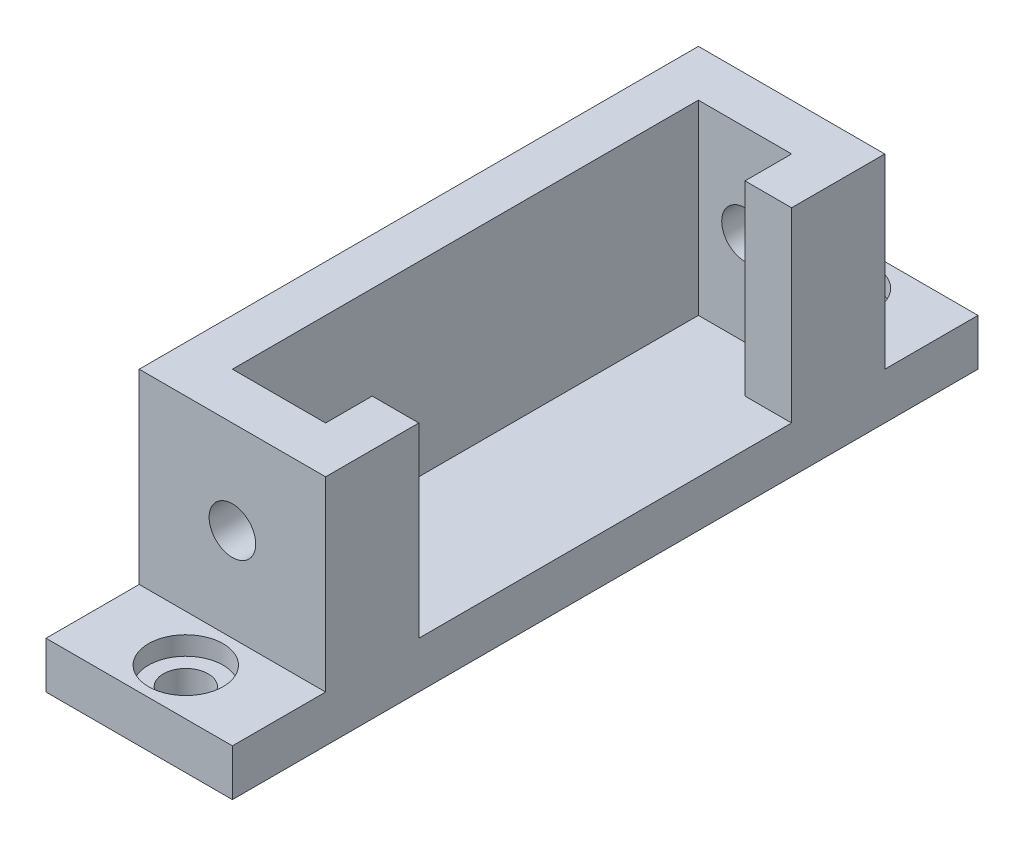
ISO-10303-21;
HEADER;
FILE_DESCRIPTION(('STEP AP214'),'2;1');
FILE_NAME('part.step','',(''),(''),'','','');
FILE_SCHEMA(('AUTOMOTIVE_DESIGN { 1 0 10303 214 1 1 1 1 }'));
ENDSEC;
DATA;
#1=APPLICATION_CONTEXT('core data for automotive mechanical design processes');
#2=APPLICATION_PROTOCOL_DEFINITION('international standard','automotive_design',2000,#1);
#3=PRODUCT_CONTEXT('',#1,'mechanical');
#4=PRODUCT('Part','Part','',(#3));
#5=PRODUCT_RELATED_PRODUCT_CATEGORY('part','',(#4));
#6=PRODUCT_DEFINITION_FORMATION('','',#4);
#7=PRODUCT_DEFINITION_CONTEXT('part definition',#1,'design');
#8=PRODUCT_DEFINITION('design','',#6,#7);
#9=PRODUCT_DEFINITION_SHAPE('','',#8);
#10=(LENGTH_UNIT() NAMED_UNIT(*) SI_UNIT(.MILLI.,.METRE.));
#11=(NAMED_UNIT(*) PLANE_ANGLE_UNIT() SI_UNIT($,.RADIAN.));
#12=(NAMED_UNIT(*) SI_UNIT($,.STERADIAN.) SOLID_ANGLE_UNIT());
#13=UNCERTAINTY_MEASURE_WITH_UNIT(LENGTH_MEASURE(1.E-05),#10,'distance_accuracy_value','');
#14=(GEOMETRIC_REPRESENTATION_CONTEXT(3) GLOBAL_UNCERTAINTY_ASSIGNED_CONTEXT((#13)) GLOBAL_UNIT_ASSIGNED_CONTEXT((#10,
#11,#12)) REPRESENTATION_CONTEXT('',''));
#15=CARTESIAN_POINT('',(0.,0.,0.));
#16=DIRECTION('',(0.,0.,1.));
#17=DIRECTION('',(1.,0.,0.));
#18=AXIS2_PLACEMENT_3D('',#15,#16,#17);
#19=CARTESIAN_POINT('',(0.,0.,0.));
#20=DIRECTION('',(0.,0.,1.));
#21=DIRECTION('',(1.,0.,0.));
#22=AXIS2_PLACEMENT_3D('',#19,#20,#21);
#23=PLANE('',#22);
#24=CARTESIAN_POINT('',(-9.94266872152012,25.,0.));
#25=DIRECTION('',(0.,0.,1.));
#26=DIRECTION('',(1.,0.,0.));
#27=AXIS2_PLACEMENT_3D('',#24,#25,#26);
#28=CIRCLE('',#27,2.5);
#29=CARTESIAN_POINT('',(-7.44266872152012,25.,0.));
#30=VERTEX_POINT('',#29);
#31=EDGE_CURVE('E237',#30,#30,#28,.T.);
#32=ORIENTED_EDGE('',*,*,#31,.T.);
#33=EDGE_LOOP('',(#32));
#34=FACE_BOUND('',#33,.T.);
#35=DIRECTION('',(1.,0.,0.));
#36=VECTOR('',#35,1.);
#37=CARTESIAN_POINT('',(0.,15.,0.));
#38=LINE('',#37,#36);
#39=CARTESIAN_POINT('',(-19.9426687215201,15.,0.));
#40=VERTEX_POINT('',#39);
#41=CARTESIAN_POINT('',(0.0573312784798757,15.,0.));
#42=VERTEX_POINT('',#41);
#43=EDGE_CURVE('E191',#40,#42,#38,.T.);
#44=ORIENTED_EDGE('',*,*,#43,.F.);
#45=DIRECTION('',(0.,1.,0.));
#46=VECTOR('',#45,1.);
#47=CARTESIAN_POINT('',(-19.9426687215201,0.,0.));
#48=LINE('',#47,#46);
#49=CARTESIAN_POINT('',(-19.9426687215201,35.,0.));
#50=VERTEX_POINT('',#49);
#51=EDGE_CURVE('E309',#40,#50,#48,.T.);
#52=ORIENTED_EDGE('',*,*,#51,.T.);
#53=DIRECTION('',(-1.,0.,0.));
#54=VECTOR('',#53,1.);
#55=CARTESIAN_POINT('',(0.,35.,0.));
#56=LINE('',#55,#54);
#57=CARTESIAN_POINT('',(0.0573312784798771,35.,0.));
#58=VERTEX_POINT('',#57);
#59=EDGE_CURVE('E328',#58,#50,#56,.T.);
#60=ORIENTED_EDGE('',*,*,#59,.F.);
#61=DIRECTION('',(0.,1.,0.));
#62=VECTOR('',#61,1.);
#63=CARTESIAN_POINT('',(0.0573312784798746,0.,0.));
#64=LINE('',#63,#62);
#65=EDGE_CURVE('E326',#42,#58,#64,.T.);
#66=ORIENTED_EDGE('',*,*,#65,.F.);
#67=EDGE_LOOP('',(#44,#52,#60,#66));
#68=FACE_BOUND('',#67,.T.);
#69=ADVANCED_FACE('F43',(#34,#68),#23,.F.);
#70=CARTESIAN_POINT('',(0.,0.,60.));
#71=DIRECTION('',(0.,0.,1.));
#72=DIRECTION('',(1.,0.,0.));
#73=AXIS2_PLACEMENT_3D('',#70,#71,#72);
#74=PLANE('',#73);
#75=CARTESIAN_POINT('',(-9.94266872152012,25.,60.));
#76=DIRECTION('',(0.,0.,1.));
#77=DIRECTION('',(1.,0.,0.));
#78=AXIS2_PLACEMENT_3D('',#75,#76,#77);
#79=CIRCLE('',#78,2.5);
#80=CARTESIAN_POINT('',(-7.44266872152012,25.,60.));
#81=VERTEX_POINT('',#80);
#82=EDGE_CURVE('E234',#81,#81,#79,.T.);
#83=ORIENTED_EDGE('',*,*,#82,.F.);
#84=EDGE_LOOP('',(#83));
#85=FACE_BOUND('',#84,.T.);
#86=DIRECTION('',(0.,1.,0.));
#87=VECTOR('',#86,1.);
#88=CARTESIAN_POINT('',(-19.9426687215201,0.,60.));
#89=LINE('',#88,#87);
#90=CARTESIAN_POINT('',(-19.9426687215201,15.,60.));
#91=VERTEX_POINT('',#90);
#92=CARTESIAN_POINT('',(-19.9426687215201,35.,60.));
#93=VERTEX_POINT('',#92);
#94=EDGE_CURVE('E60',#91,#93,#89,.T.);
#95=ORIENTED_EDGE('',*,*,#94,.F.);
#96=DIRECTION('',(1.,0.,0.));
#97=VECTOR('',#96,1.);
#98=CARTESIAN_POINT('',(0.,15.,60.));
#99=LINE('',#98,#97);
#100=CARTESIAN_POINT('',(0.0573312784798757,15.,60.));
#101=VERTEX_POINT('',#100);
#102=EDGE_CURVE('E65',#91,#101,#99,.T.);
#103=ORIENTED_EDGE('',*,*,#102,.T.);
#104=DIRECTION('',(0.,1.,0.));
#105=VECTOR('',#104,1.);
#106=CARTESIAN_POINT('',(0.0573312784798746,0.,60.));
#107=LINE('',#106,#105);
#108=CARTESIAN_POINT('',(0.0573312784798771,35.,60.));
#109=VERTEX_POINT('',#108);
#110=EDGE_CURVE('E313',#101,#109,#107,.T.);
#111=ORIENTED_EDGE('',*,*,#110,.T.);
#112=DIRECTION('',(-1.,0.,0.));
#113=VECTOR('',#112,1.);
#114=CARTESIAN_POINT('',(0.,35.,60.));
#115=LINE('',#114,#113);
#116=EDGE_CURVE('E315',#109,#93,#115,.T.);
#117=ORIENTED_EDGE('',*,*,#116,.T.);
#118=EDGE_LOOP('',(#95,#103,#111,#117));
#119=FACE_BOUND('',#118,.T.);
#120=ADVANCED_FACE('F393',(#85,#119),#74,.T.);
#121=CARTESIAN_POINT('',(0.0573312784798746,0.,60.));
#122=DIRECTION('',(-1.,0.,0.));
#123=DIRECTION('',(0.,-1.,0.));
#124=AXIS2_PLACEMENT_3D('',#121,#122,#123);
#125=PLANE('',#124);
#126=DIRECTION('',(0.,1.,0.));
#127=VECTOR('',#126,1.);
#128=CARTESIAN_POINT('',(0.0573312784798771,15.,10.));
#129=LINE('',#128,#127);
#130=CARTESIAN_POINT('',(0.0573312784798771,15.,10.));
#131=VERTEX_POINT('',#130);
#132=CARTESIAN_POINT('',(0.0573312784798771,35.,10.));
#133=VERTEX_POINT('',#132);
#134=EDGE_CURVE('E298',#131,#133,#129,.T.);
#135=ORIENTED_EDGE('',*,*,#134,.F.);
#136=DIRECTION('',(0.,0.,-1.));
#137=VECTOR('',#136,1.);
#138=CARTESIAN_POINT('',(0.0573312784798771,15.,0.));
#139=LINE('',#138,#137);
#140=CARTESIAN_POINT('',(0.0573312784798771,15.,50.));
#141=VERTEX_POINT('',#140);
#142=EDGE_CURVE('E252',#141,#131,#139,.T.);
#143=ORIENTED_EDGE('',*,*,#142,.F.);
#144=DIRECTION('',(0.,1.,0.));
#145=VECTOR('',#144,1.);
#146=CARTESIAN_POINT('',(0.0573312784798771,15.,50.));
#147=LINE('',#146,#145);
#148=CARTESIAN_POINT('',(0.0573312784798771,35.,50.));
#149=VERTEX_POINT('',#148);
#150=EDGE_CURVE('E300',#141,#149,#147,.T.);
#151=ORIENTED_EDGE('',*,*,#150,.T.);
#152=DIRECTION('',(0.,0.,-1.));
#153=VECTOR('',#152,1.);
#154=CARTESIAN_POINT('',(0.0573312784798771,35.,60.));
#155=LINE('',#154,#153);
#156=EDGE_CURVE('E340',#109,#149,#155,.T.);
#157=ORIENTED_EDGE('',*,*,#156,.F.);
#158=ORIENTED_EDGE('',*,*,#110,.F.);
#159=DIRECTION('',(0.,0.,-1.));
#160=VECTOR('',#159,1.);
#161=CARTESIAN_POINT('',(0.0573312784798757,15.,70.));
#162=LINE('',#161,#160);
#163=CARTESIAN_POINT('',(0.0573312784798757,15.,70.));
#164=VERTEX_POINT('',#163);
#165=EDGE_CURVE('E225',#164,#101,#162,.T.);
#166=ORIENTED_EDGE('',*,*,#165,.F.);
#167=DIRECTION('',(0.,1.,0.));
#168=VECTOR('',#167,1.);
#169=CARTESIAN_POINT('',(0.0573312784798746,0.,70.));
#170=LINE('',#169,#168);
#171=CARTESIAN_POINT('',(0.0573312784798753,9.99999999999998,70.));
#172=VERTEX_POINT('',#171);
#173=EDGE_CURVE('E223',#172,#164,#170,.T.);
#174=ORIENTED_EDGE('',*,*,#173,.F.);
#175=DIRECTION('',(0.,0.,-1.));
#176=VECTOR('',#175,1.);
#177=CARTESIAN_POINT('',(0.0573312784798753,9.99999999999998,60.));
#178=LINE('',#177,#176);
#179=CARTESIAN_POINT('',(0.0573312784798753,9.99999999999998,-10.));
#180=VERTEX_POINT('',#179);
#181=EDGE_CURVE('E204',#172,#180,#178,.T.);
#182=ORIENTED_EDGE('',*,*,#181,.T.);
#183=DIRECTION('',(0.,1.,0.));
#184=VECTOR('',#183,1.);
#185=CARTESIAN_POINT('',(0.0573312784798746,0.,-10.));
#186=LINE('',#185,#184);
#187=CARTESIAN_POINT('',(0.0573312784798757,15.,-10.));
#188=VERTEX_POINT('',#187);
#189=EDGE_CURVE('E186',#180,#188,#186,.T.);
#190=ORIENTED_EDGE('',*,*,#189,.T.);
#191=DIRECTION('',(0.,0.,1.));
#192=VECTOR('',#191,1.);
#193=CARTESIAN_POINT('',(0.0573312784798757,15.,-10.));
#194=LINE('',#193,#192);
#195=EDGE_CURVE('E194',#188,#42,#194,.T.);
#196=ORIENTED_EDGE('',*,*,#195,.T.);
#197=ORIENTED_EDGE('',*,*,#65,.T.);
#198=EDGE_CURVE('E339',#133,#58,#155,.T.);
#199=ORIENTED_EDGE('',*,*,#198,.F.);
#200=EDGE_LOOP('',(#135,#143,#151,#157,#158,#166,#174,#182,#190,#196,#197,#199));
#201=FACE_BOUND('',#200,.T.);
#202=ADVANCED_FACE('F202',(#201),#125,.F.);
#203=CARTESIAN_POINT('',(0.,35.,60.));
#204=DIRECTION('',(0.,-1.,0.));
#205=DIRECTION('',(0.,0.,-1.));
#206=AXIS2_PLACEMENT_3D('',#203,#204,#205);
#207=PLANE('',#206);
#208=DIRECTION('',(1.,0.,0.));
#209=VECTOR('',#208,1.);
#210=CARTESIAN_POINT('',(0.,35.,10.));
#211=LINE('',#210,#209);
#212=CARTESIAN_POINT('',(-4.94266872152012,35.,10.));
#213=VERTEX_POINT('',#212);
#214=EDGE_CURVE('E273',#213,#133,#211,.T.);
#215=ORIENTED_EDGE('',*,*,#214,.T.);
#216=ORIENTED_EDGE('',*,*,#198,.T.);
#217=ORIENTED_EDGE('',*,*,#59,.T.);
#218=DIRECTION('',(0.,0.,-1.));
#219=VECTOR('',#218,1.);
#220=CARTESIAN_POINT('',(-19.9426687215201,35.,60.));
#221=LINE('',#220,#219);
#222=EDGE_CURVE('E336',#93,#50,#221,.T.);
#223=ORIENTED_EDGE('',*,*,#222,.F.);
#224=ORIENTED_EDGE('',*,*,#116,.F.);
#225=ORIENTED_EDGE('',*,*,#156,.T.);
#226=DIRECTION('',(1.,0.,0.));
#227=VECTOR('',#226,1.);
#228=CARTESIAN_POINT('',(0.,35.,50.));
#229=LINE('',#228,#227);
#230=CARTESIAN_POINT('',(-4.94266872152012,35.,50.));
#231=VERTEX_POINT('',#230);
#232=EDGE_CURVE('E271',#231,#149,#229,.T.);
#233=ORIENTED_EDGE('',*,*,#232,.F.);
#234=DIRECTION('',(0.,0.,-1.));
#235=VECTOR('',#234,1.);
#236=CARTESIAN_POINT('',(-4.94266872152012,35.,0.));
#237=LINE('',#236,#235);
#238=CARTESIAN_POINT('',(-4.94266872152012,35.,55.));
#239=VERTEX_POINT('',#238);
#240=EDGE_CURVE('E244',#239,#231,#237,.T.);
#241=ORIENTED_EDGE('',*,*,#240,.F.);
#242=DIRECTION('',(1.,0.,0.));
#243=VECTOR('',#242,1.);
#244=CARTESIAN_POINT('',(0.,35.,55.));
#245=LINE('',#244,#243);
#246=CARTESIAN_POINT('',(-14.9426687215201,35.,55.));
#247=VERTEX_POINT('',#246);
#248=EDGE_CURVE('E249',#247,#239,#245,.T.);
#249=ORIENTED_EDGE('',*,*,#248,.F.);
#250=DIRECTION('',(0.,0.,1.));
#251=VECTOR('',#250,1.);
#252=CARTESIAN_POINT('',(-14.9426687215201,35.,0.));
#253=LINE('',#252,#251);
#254=CARTESIAN_POINT('',(-14.9426687215201,35.,5.));
#255=VERTEX_POINT('',#254);
#256=EDGE_CURVE('E282',#255,#247,#253,.T.);
#257=ORIENTED_EDGE('',*,*,#256,.F.);
#258=DIRECTION('',(-1.,0.,0.));
#259=VECTOR('',#258,1.);
#260=CARTESIAN_POINT('',(0.,35.,5.));
#261=LINE('',#260,#259);
#262=CARTESIAN_POINT('',(-4.94266872152012,35.,5.));
#263=VERTEX_POINT('',#262);
#264=EDGE_CURVE('E279',#263,#255,#261,.T.);
#265=ORIENTED_EDGE('',*,*,#264,.F.);
#266=DIRECTION('',(0.,0.,-1.));
#267=VECTOR('',#266,1.);
#268=CARTESIAN_POINT('',(-4.94266872152012,35.,0.));
#269=LINE('',#268,#267);
#270=EDGE_CURVE('E276',#213,#263,#269,.T.);
#271=ORIENTED_EDGE('',*,*,#270,.F.);
#272=EDGE_LOOP('',(#215,#216,#217,#223,#224,#225,#233,#241,#249,#257,#265,#271));
#273=FACE_BOUND('',#272,.T.);
#274=ADVANCED_FACE('F443',(#273),#207,.F.);
#275=CARTESIAN_POINT('',(-12.3426687215201,0.,60.));
#276=DIRECTION('',(-1.,0.,0.));
#277=DIRECTION('',(0.,0.,1.));
#278=AXIS2_PLACEMENT_3D('',#275,#276,#277);
#279=PLANE('',#278);
#280=DIRECTION('',(0.,1.,0.));
#281=VECTOR('',#280,1.);
#282=CARTESIAN_POINT('',(-12.3426687215201,0.,0.));
#283=LINE('',#282,#281);
#284=CARTESIAN_POINT('',(-12.3426687215201,7.99999999999998,0.));
#285=VERTEX_POINT('',#284);
#286=CARTESIAN_POINT('',(-12.3426687215201,9.99999999999998,0.));
#287=VERTEX_POINT('',#286);
#288=EDGE_CURVE('E289',#285,#287,#283,.T.);
#289=ORIENTED_EDGE('',*,*,#288,.F.);
#290=DIRECTION('',(0.,0.,-1.));
#291=VECTOR('',#290,1.);
#292=CARTESIAN_POINT('',(-12.3426687215201,7.99999999999998,60.));
#293=LINE('',#292,#291);
#294=CARTESIAN_POINT('',(-12.3426687215201,7.99999999999998,60.));
#295=VERTEX_POINT('',#294);
#296=EDGE_CURVE('E229',#295,#285,#293,.T.);
#297=ORIENTED_EDGE('',*,*,#296,.F.);
#298=DIRECTION('',(0.,1.,0.));
#299=VECTOR('',#298,1.);
#300=CARTESIAN_POINT('',(-12.3426687215201,0.,60.));
#301=LINE('',#300,#299);
#302=CARTESIAN_POINT('',(-12.3426687215201,9.99999999999998,60.));
#303=VERTEX_POINT('',#302);
#304=EDGE_CURVE('E305',#295,#303,#301,.T.);
#305=ORIENTED_EDGE('',*,*,#304,.T.);
#306=DIRECTION('',(0.,0.,-1.));
#307=VECTOR('',#306,1.);
#308=CARTESIAN_POINT('',(-12.3426687215201,9.99999999999998,60.));
#309=LINE('',#308,#307);
#310=EDGE_CURVE('E318',#303,#287,#309,.T.);
#311=ORIENTED_EDGE('',*,*,#310,.T.);
#312=EDGE_LOOP('',(#289,#297,#305,#311));
#313=FACE_BOUND('',#312,.T.);
#314=ADVANCED_FACE('F45',(#313),#279,.T.);
#315=CARTESIAN_POINT('',(-9.94266872152012,7.99999999999998,60.));
#316=DIRECTION('',(0.,0.,-1.));
#317=DIRECTION('',(-1.,0.,0.));
#318=AXIS2_PLACEMENT_3D('',#315,#316,#317);
#319=CYLINDRICAL_SURFACE('',#318,2.4);
#320=CARTESIAN_POINT('',(-9.94266872152012,7.99999999999998,0.));
#321=DIRECTION('',(0.,0.,1.));
#322=DIRECTION('',(1.,0.,0.));
#323=AXIS2_PLACEMENT_3D('',#320,#321,#322);
#324=CIRCLE('',#323,2.4);
#325=CARTESIAN_POINT('',(-7.54266872152012,7.99999999999997,0.));
#326=VERTEX_POINT('',#325);
#327=EDGE_CURVE('E321',#285,#326,#324,.T.);
#328=ORIENTED_EDGE('',*,*,#327,.T.);
#329=DIRECTION('',(0.,0.,-1.));
#330=VECTOR('',#329,1.);
#331=CARTESIAN_POINT('',(-7.54266872152012,7.99999999999997,60.));
#332=LINE('',#331,#330);
#333=CARTESIAN_POINT('',(-7.54266872152012,7.99999999999997,60.));
#334=VERTEX_POINT('',#333);
#335=EDGE_CURVE('E347',#334,#326,#332,.T.);
#336=ORIENTED_EDGE('',*,*,#335,.F.);
#337=CARTESIAN_POINT('',(-9.94266872152012,7.99999999999998,60.));
#338=DIRECTION('',(0.,0.,1.));
#339=DIRECTION('',(1.,0.,0.));
#340=AXIS2_PLACEMENT_3D('',#337,#338,#339);
#341=CIRCLE('',#340,2.4);
#342=EDGE_CURVE('E308',#295,#334,#341,.T.);
#343=ORIENTED_EDGE('',*,*,#342,.F.);
#344=ORIENTED_EDGE('',*,*,#296,.T.);
#345=EDGE_LOOP('',(#328,#336,#343,#344));
#346=FACE_BOUND('',#345,.T.);
#347=ADVANCED_FACE('F434',(#346),#319,.T.);
#348=CARTESIAN_POINT('',(-7.54266872152012,0.,60.));
#349=DIRECTION('',(-1.,0.,0.));
#350=DIRECTION('',(0.,-1.,0.));
#351=AXIS2_PLACEMENT_3D('',#348,#349,#350);
#352=PLANE('',#351);
#353=DIRECTION('',(0.,1.,0.));
#354=VECTOR('',#353,1.);
#355=CARTESIAN_POINT('',(-7.54266872152012,0.,0.));
#356=LINE('',#355,#354);
#357=CARTESIAN_POINT('',(-7.54266872152012,9.99999999999998,0.));
#358=VERTEX_POINT('',#357);
#359=EDGE_CURVE('E323',#326,#358,#356,.T.);
#360=ORIENTED_EDGE('',*,*,#359,.T.);
#361=DIRECTION('',(0.,0.,-1.));
#362=VECTOR('',#361,1.);
#363=CARTESIAN_POINT('',(-7.54266872152012,9.99999999999998,60.));
#364=LINE('',#363,#362);
#365=CARTESIAN_POINT('',(-7.54266872152012,9.99999999999998,60.));
#366=VERTEX_POINT('',#365);
#367=EDGE_CURVE('E344',#366,#358,#364,.T.);
#368=ORIENTED_EDGE('',*,*,#367,.F.);
#369=DIRECTION('',(0.,1.,0.));
#370=VECTOR('',#369,1.);
#371=CARTESIAN_POINT('',(-7.54266872152012,0.,60.));
#372=LINE('',#371,#370);
#373=EDGE_CURVE('E311',#334,#366,#372,.T.);
#374=ORIENTED_EDGE('',*,*,#373,.F.);
#375=ORIENTED_EDGE('',*,*,#335,.T.);
#376=EDGE_LOOP('',(#360,#368,#374,#375));
#377=FACE_BOUND('',#376,.T.);
#378=ADVANCED_FACE('F431',(#377),#352,.F.);
#379=CARTESIAN_POINT('',(-19.9426687215201,0.,60.));
#380=DIRECTION('',(-1.,0.,0.));
#381=DIRECTION('',(0.,-1.,0.));
#382=AXIS2_PLACEMENT_3D('',#379,#380,#381);
#383=PLANE('',#382);
#384=ORIENTED_EDGE('',*,*,#51,.F.);
#385=DIRECTION('',(0.,0.,1.));
#386=VECTOR('',#385,1.);
#387=CARTESIAN_POINT('',(-19.9426687215201,15.,-10.));
#388=LINE('',#387,#386);
#389=CARTESIAN_POINT('',(-19.9426687215201,15.,-10.));
#390=VERTEX_POINT('',#389);
#391=EDGE_CURVE('E199',#390,#40,#388,.T.);
#392=ORIENTED_EDGE('',*,*,#391,.F.);
#393=DIRECTION('',(0.,-1.,0.));
#394=VECTOR('',#393,1.);
#395=CARTESIAN_POINT('',(-19.9426687215201,0.,-10.));
#396=LINE('',#395,#394);
#397=CARTESIAN_POINT('',(-19.9426687215201,9.99999999999998,-10.));
#398=VERTEX_POINT('',#397);
#399=EDGE_CURVE('E189',#390,#398,#396,.T.);
#400=ORIENTED_EDGE('',*,*,#399,.T.);
#401=DIRECTION('',(0.,0.,-1.));
#402=VECTOR('',#401,1.);
#403=CARTESIAN_POINT('',(-19.9426687215201,9.99999999999998,60.));
#404=LINE('',#403,#402);
#405=CARTESIAN_POINT('',(-19.9426687215201,9.99999999999998,70.));
#406=VERTEX_POINT('',#405);
#407=EDGE_CURVE('E334',#406,#398,#404,.T.);
#408=ORIENTED_EDGE('',*,*,#407,.F.);
#409=DIRECTION('',(0.,-1.,0.));
#410=VECTOR('',#409,1.);
#411=CARTESIAN_POINT('',(-19.9426687215201,0.,70.));
#412=LINE('',#411,#410);
#413=CARTESIAN_POINT('',(-19.9426687215201,15.,70.));
#414=VERTEX_POINT('',#413);
#415=EDGE_CURVE('E217',#414,#406,#412,.T.);
#416=ORIENTED_EDGE('',*,*,#415,.F.);
#417=DIRECTION('',(0.,0.,-1.));
#418=VECTOR('',#417,1.);
#419=CARTESIAN_POINT('',(-19.9426687215201,15.,70.));
#420=LINE('',#419,#418);
#421=EDGE_CURVE('E232',#414,#91,#420,.T.);
#422=ORIENTED_EDGE('',*,*,#421,.T.);
#423=ORIENTED_EDGE('',*,*,#94,.T.);
#424=ORIENTED_EDGE('',*,*,#222,.T.);
#425=EDGE_LOOP('',(#384,#392,#400,#408,#416,#422,#423,#424));
#426=FACE_BOUND('',#425,.T.);
#427=ADVANCED_FACE('F440',(#426),#383,.T.);
#428=CARTESIAN_POINT('',(0.,9.99999999999998,60.));
#429=DIRECTION('',(0.,1.,0.));
#430=DIRECTION('',(-1.,0.,0.));
#431=AXIS2_PLACEMENT_3D('',#428,#429,#430);
#432=PLANE('',#431);
#433=CARTESIAN_POINT('',(-9.97133436076006,9.99999999999998,-5.00000000000001));
#434=DIRECTION('',(0.,1.,0.));
#435=DIRECTION('',(-1.,0.,0.));
#436=AXIS2_PLACEMENT_3D('',#433,#434,#435);
#437=CIRCLE('',#436,2.4);
#438=CARTESIAN_POINT('',(-12.3713343607601,9.99999999999998,-5.00000000000001));
#439=VERTEX_POINT('',#438);
#440=EDGE_CURVE('E47',#439,#439,#437,.T.);
#441=ORIENTED_EDGE('',*,*,#440,.T.);
#442=EDGE_LOOP('',(#441));
#443=FACE_BOUND('',#442,.T.);
#444=CARTESIAN_POINT('',(-9.94266872152013,9.99999999999998,65.));
#445=DIRECTION('',(0.,1.,0.));
#446=DIRECTION('',(-1.,0.,0.));
#447=AXIS2_PLACEMENT_3D('',#444,#445,#446);
#448=CIRCLE('',#447,2.4);
#449=CARTESIAN_POINT('',(-12.3426687215201,9.99999999999998,65.));
#450=VERTEX_POINT('',#449);
#451=EDGE_CURVE('E211',#450,#450,#448,.T.);
#452=ORIENTED_EDGE('',*,*,#451,.T.);
#453=EDGE_LOOP('',(#452));
#454=FACE_BOUND('',#453,.T.);
#455=DIRECTION('',(1.,0.,0.));
#456=VECTOR('',#455,1.);
#457=CARTESIAN_POINT('',(0.,9.99999999999998,0.));
#458=LINE('',#457,#456);
#459=EDGE_CURVE('E11',#287,#358,#458,.T.);
#460=ORIENTED_EDGE('',*,*,#459,.F.);
#461=ORIENTED_EDGE('',*,*,#310,.F.);
#462=DIRECTION('',(1.,0.,0.));
#463=VECTOR('',#462,1.);
#464=CARTESIAN_POINT('',(0.,9.99999999999998,60.));
#465=LINE('',#464,#463);
#466=EDGE_CURVE('E52',#303,#366,#465,.T.);
#467=ORIENTED_EDGE('',*,*,#466,.T.);
#468=ORIENTED_EDGE('',*,*,#367,.T.);
#469=EDGE_LOOP('',(#460,#461,#467,#468));
#470=FACE_BOUND('',#469,.T.);
#471=ORIENTED_EDGE('',*,*,#407,.T.);
#472=DIRECTION('',(1.,0.,0.));
#473=VECTOR('',#472,1.);
#474=CARTESIAN_POINT('',(0.,9.99999999999998,-10.));
#475=LINE('',#474,#473);
#476=EDGE_CURVE('E205',#398,#180,#475,.T.);
#477=ORIENTED_EDGE('',*,*,#476,.T.);
#478=ORIENTED_EDGE('',*,*,#181,.F.);
#479=DIRECTION('',(1.,0.,0.));
#480=VECTOR('',#479,1.);
#481=CARTESIAN_POINT('',(0.,9.99999999999998,70.));
#482=LINE('',#481,#480);
#483=EDGE_CURVE('E220',#406,#172,#482,.T.);
#484=ORIENTED_EDGE('',*,*,#483,.F.);
#485=EDGE_LOOP('',(#471,#477,#478,#484));
#486=FACE_BOUND('',#485,.T.);
#487=ADVANCED_FACE('F417',(#443,#454,#470,#486),#432,.F.);
#488=ORIENTED_EDGE('',*,*,#466,.F.);
#489=ORIENTED_EDGE('',*,*,#304,.F.);
#490=ORIENTED_EDGE('',*,*,#342,.T.);
#491=ORIENTED_EDGE('',*,*,#373,.T.);
#492=EDGE_LOOP('',(#488,#489,#490,#491));
#493=FACE_BOUND('',#492,.T.);
#494=ADVANCED_FACE('F403',(#493),#74,.T.);
#495=ORIENTED_EDGE('',*,*,#288,.T.);
#496=ORIENTED_EDGE('',*,*,#459,.T.);
#497=ORIENTED_EDGE('',*,*,#359,.F.);
#498=ORIENTED_EDGE('',*,*,#327,.F.);
#499=EDGE_LOOP('',(#495,#496,#497,#498));
#500=FACE_BOUND('',#499,.T.);
#501=ADVANCED_FACE('F396',(#500),#23,.F.);
#502=CARTESIAN_POINT('',(-4.94266872152012,15.,0.));
#503=DIRECTION('',(1.,0.,0.));
#504=DIRECTION('',(0.,0.,-1.));
#505=AXIS2_PLACEMENT_3D('',#502,#503,#504);
#506=PLANE('',#505);
#507=ORIENTED_EDGE('',*,*,#240,.T.);
#508=DIRECTION('',(0.,1.,0.));
#509=VECTOR('',#508,1.);
#510=CARTESIAN_POINT('',(-4.94266872152012,15.,50.));
#511=LINE('',#510,#509);
#512=CARTESIAN_POINT('',(-4.94266872152012,15.,50.));
#513=VERTEX_POINT('',#512);
#514=EDGE_CURVE('E269',#513,#231,#511,.T.);
#515=ORIENTED_EDGE('',*,*,#514,.F.);
#516=DIRECTION('',(0.,0.,-1.));
#517=VECTOR('',#516,1.);
#518=CARTESIAN_POINT('',(-4.94266872152012,15.,0.));
#519=LINE('',#518,#517);
#520=CARTESIAN_POINT('',(-4.94266872152012,15.,55.));
#521=VERTEX_POINT('',#520);
#522=EDGE_CURVE('E245',#521,#513,#519,.T.);
#523=ORIENTED_EDGE('',*,*,#522,.F.);
#524=DIRECTION('',(0.,1.,0.));
#525=VECTOR('',#524,1.);
#526=CARTESIAN_POINT('',(-4.94266872152012,15.,55.));
#527=LINE('',#526,#525);
#528=EDGE_CURVE('E287',#521,#239,#527,.T.);
#529=ORIENTED_EDGE('',*,*,#528,.T.);
#530=EDGE_LOOP('',(#507,#515,#523,#529));
#531=FACE_BOUND('',#530,.T.);
#532=ADVANCED_FACE('F407',(#531),#506,.F.);
#533=CARTESIAN_POINT('',(0.,15.,55.));
#534=DIRECTION('',(0.,0.,1.));
#535=DIRECTION('',(1.,0.,0.));
#536=AXIS2_PLACEMENT_3D('',#533,#534,#535);
#537=PLANE('',#536);
#538=CARTESIAN_POINT('',(-9.94266872152012,25.,55.));
#539=DIRECTION('',(0.,0.,1.));
#540=DIRECTION('',(1.,0.,0.));
#541=AXIS2_PLACEMENT_3D('',#538,#539,#540);
#542=CIRCLE('',#541,2.5);
#543=CARTESIAN_POINT('',(-7.44266872152012,25.,55.));
#544=VERTEX_POINT('',#543);
#545=EDGE_CURVE('E241',#544,#544,#542,.T.);
#546=ORIENTED_EDGE('',*,*,#545,.T.);
#547=EDGE_LOOP('',(#546));
#548=FACE_BOUND('',#547,.T.);
#549=ORIENTED_EDGE('',*,*,#248,.T.);
#550=ORIENTED_EDGE('',*,*,#528,.F.);
#551=DIRECTION('',(1.,0.,0.));
#552=VECTOR('',#551,1.);
#553=CARTESIAN_POINT('',(0.,15.,55.));
#554=LINE('',#553,#552);
#555=CARTESIAN_POINT('',(-14.9426687215201,15.,55.));
#556=VERTEX_POINT('',#555);
#557=EDGE_CURVE('E266',#556,#521,#554,.T.);
#558=ORIENTED_EDGE('',*,*,#557,.F.);
#559=DIRECTION('',(0.,1.,0.));
#560=VECTOR('',#559,1.);
#561=CARTESIAN_POINT('',(-14.9426687215201,15.,55.));
#562=LINE('',#561,#560);
#563=EDGE_CURVE('E290',#556,#247,#562,.T.);
#564=ORIENTED_EDGE('',*,*,#563,.T.);
#565=EDGE_LOOP('',(#549,#550,#558,#564));
#566=FACE_BOUND('',#565,.T.);
#567=ADVANCED_FACE('F413',(#548,#566),#537,.F.);
#568=CARTESIAN_POINT('',(-14.9426687215201,15.,0.));
#569=DIRECTION('',(-1.,0.,0.));
#570=DIRECTION('',(0.,0.,1.));
#571=AXIS2_PLACEMENT_3D('',#568,#569,#570);
#572=PLANE('',#571);
#573=ORIENTED_EDGE('',*,*,#256,.T.);
#574=ORIENTED_EDGE('',*,*,#563,.F.);
#575=DIRECTION('',(0.,0.,1.));
#576=VECTOR('',#575,1.);
#577=CARTESIAN_POINT('',(-14.9426687215201,15.,0.));
#578=LINE('',#577,#576);
#579=CARTESIAN_POINT('',(-14.9426687215201,15.,5.));
#580=VERTEX_POINT('',#579);
#581=EDGE_CURVE('E263',#580,#556,#578,.T.);
#582=ORIENTED_EDGE('',*,*,#581,.F.);
#583=DIRECTION('',(0.,1.,0.));
#584=VECTOR('',#583,1.);
#585=CARTESIAN_POINT('',(-14.9426687215201,15.,5.));
#586=LINE('',#585,#584);
#587=EDGE_CURVE('E292',#580,#255,#586,.T.);
#588=ORIENTED_EDGE('',*,*,#587,.T.);
#589=EDGE_LOOP('',(#573,#574,#582,#588));
#590=FACE_BOUND('',#589,.T.);
#591=ADVANCED_FACE('F610',(#590),#572,.F.);
#592=CARTESIAN_POINT('',(0.,15.,5.));
#593=DIRECTION('',(0.,0.,-1.));
#594=DIRECTION('',(-1.,0.,0.));
#595=AXIS2_PLACEMENT_3D('',#592,#593,#594);
#596=PLANE('',#595);
#597=CARTESIAN_POINT('',(-9.94266872152012,25.,5.));
#598=DIRECTION('',(0.,0.,-1.));
#599=DIRECTION('',(-1.,0.,0.));
#600=AXIS2_PLACEMENT_3D('',#597,#598,#599);
#601=CIRCLE('',#600,2.5);
#602=CARTESIAN_POINT('',(-12.4426687215201,25.,5.));
#603=VERTEX_POINT('',#602);
#604=EDGE_CURVE('E240',#603,#603,#601,.T.);
#605=ORIENTED_EDGE('',*,*,#604,.T.);
#606=EDGE_LOOP('',(#605));
#607=FACE_BOUND('',#606,.T.);
#608=ORIENTED_EDGE('',*,*,#264,.T.);
#609=ORIENTED_EDGE('',*,*,#587,.F.);
#610=DIRECTION('',(-1.,0.,0.));
#611=VECTOR('',#610,1.);
#612=CARTESIAN_POINT('',(0.,15.,5.));
#613=LINE('',#612,#611);
#614=CARTESIAN_POINT('',(-4.94266872152012,15.,5.));
#615=VERTEX_POINT('',#614);
#616=EDGE_CURVE('E260',#615,#580,#613,.T.);
#617=ORIENTED_EDGE('',*,*,#616,.F.);
#618=DIRECTION('',(0.,1.,0.));
#619=VECTOR('',#618,1.);
#620=CARTESIAN_POINT('',(-4.94266872152012,15.,5.));
#621=LINE('',#620,#619);
#622=EDGE_CURVE('E294',#615,#263,#621,.T.);
#623=ORIENTED_EDGE('',*,*,#622,.T.);
#624=EDGE_LOOP('',(#608,#609,#617,#623));
#625=FACE_BOUND('',#624,.T.);
#626=ADVANCED_FACE('F601',(#607,#625),#596,.F.);
#627=CARTESIAN_POINT('',(-4.94266872152012,15.,0.));
#628=DIRECTION('',(1.,0.,0.));
#629=DIRECTION('',(0.,0.,-1.));
#630=AXIS2_PLACEMENT_3D('',#627,#628,#629);
#631=PLANE('',#630);
#632=ORIENTED_EDGE('',*,*,#270,.T.);
#633=ORIENTED_EDGE('',*,*,#622,.F.);
#634=DIRECTION('',(0.,0.,-1.));
#635=VECTOR('',#634,1.);
#636=CARTESIAN_POINT('',(-4.94266872152012,15.,0.));
#637=LINE('',#636,#635);
#638=CARTESIAN_POINT('',(-4.94266872152012,15.,10.));
#639=VERTEX_POINT('',#638);
#640=EDGE_CURVE('E257',#639,#615,#637,.T.);
#641=ORIENTED_EDGE('',*,*,#640,.F.);
#642=DIRECTION('',(0.,1.,0.));
#643=VECTOR('',#642,1.);
#644=CARTESIAN_POINT('',(-4.94266872152012,15.,10.));
#645=LINE('',#644,#643);
#646=EDGE_CURVE('E296',#639,#213,#645,.T.);
#647=ORIENTED_EDGE('',*,*,#646,.T.);
#648=EDGE_LOOP('',(#632,#633,#641,#647));
#649=FACE_BOUND('',#648,.T.);
#650=ADVANCED_FACE('F592',(#649),#631,.F.);
#651=CARTESIAN_POINT('',(0.,15.,10.));
#652=DIRECTION('',(0.,0.,1.));
#653=DIRECTION('',(1.,0.,0.));
#654=AXIS2_PLACEMENT_3D('',#651,#652,#653);
#655=PLANE('',#654);
#656=ORIENTED_EDGE('',*,*,#214,.F.);
#657=ORIENTED_EDGE('',*,*,#646,.F.);
#658=DIRECTION('',(1.,0.,0.));
#659=VECTOR('',#658,1.);
#660=CARTESIAN_POINT('',(0.,15.,10.));
#661=LINE('',#660,#659);
#662=EDGE_CURVE('E255',#639,#131,#661,.T.);
#663=ORIENTED_EDGE('',*,*,#662,.T.);
#664=ORIENTED_EDGE('',*,*,#134,.T.);
#665=EDGE_LOOP('',(#656,#657,#663,#664));
#666=FACE_BOUND('',#665,.T.);
#667=ADVANCED_FACE('F583',(#666),#655,.T.);
#668=CARTESIAN_POINT('',(0.,15.,50.));
#669=DIRECTION('',(0.,0.,1.));
#670=DIRECTION('',(1.,0.,0.));
#671=AXIS2_PLACEMENT_3D('',#668,#669,#670);
#672=PLANE('',#671);
#673=ORIENTED_EDGE('',*,*,#232,.T.);
#674=ORIENTED_EDGE('',*,*,#150,.F.);
#675=DIRECTION('',(1.,0.,0.));
#676=VECTOR('',#675,1.);
#677=CARTESIAN_POINT('',(0.,15.,50.));
#678=LINE('',#677,#676);
#679=EDGE_CURVE('E248',#513,#141,#678,.T.);
#680=ORIENTED_EDGE('',*,*,#679,.F.);
#681=ORIENTED_EDGE('',*,*,#514,.T.);
#682=EDGE_LOOP('',(#673,#674,#680,#681));
#683=FACE_BOUND('',#682,.T.);
#684=ADVANCED_FACE('F573',(#683),#672,.F.);
#685=CARTESIAN_POINT('',(0.,15.,0.));
#686=DIRECTION('',(0.,1.,0.));
#687=DIRECTION('',(0.,0.,1.));
#688=AXIS2_PLACEMENT_3D('',#685,#686,#687);
#689=PLANE('',#688);
#690=ORIENTED_EDGE('',*,*,#522,.T.);
#691=ORIENTED_EDGE('',*,*,#679,.T.);
#692=ORIENTED_EDGE('',*,*,#142,.T.);
#693=ORIENTED_EDGE('',*,*,#662,.F.);
#694=ORIENTED_EDGE('',*,*,#640,.T.);
#695=ORIENTED_EDGE('',*,*,#616,.T.);
#696=ORIENTED_EDGE('',*,*,#581,.T.);
#697=ORIENTED_EDGE('',*,*,#557,.T.);
#698=EDGE_LOOP('',(#690,#691,#692,#693,#694,#695,#696,#697));
#699=FACE_BOUND('',#698,.T.);
#700=ADVANCED_FACE('F564',(#699),#689,.T.);
#701=CARTESIAN_POINT('',(-9.94266872152012,25.,0.));
#702=DIRECTION('',(0.,0.,1.));
#703=DIRECTION('',(1.,0.,0.));
#704=AXIS2_PLACEMENT_3D('',#701,#702,#703);
#705=CYLINDRICAL_SURFACE('',#704,2.5);
#706=ORIENTED_EDGE('',*,*,#31,.F.);
#707=EDGE_LOOP('',(#706));
#708=FACE_BOUND('',#707,.T.);
#709=ORIENTED_EDGE('',*,*,#604,.F.);
#710=EDGE_LOOP('',(#709));
#711=FACE_BOUND('',#710,.T.);
#712=ADVANCED_FACE('F555',(#708,#711),#705,.F.);
#713=ORIENTED_EDGE('',*,*,#82,.T.);
#714=EDGE_LOOP('',(#713));
#715=FACE_BOUND('',#714,.T.);
#716=ORIENTED_EDGE('',*,*,#545,.F.);
#717=EDGE_LOOP('',(#716));
#718=FACE_BOUND('',#717,.T.);
#719=ADVANCED_FACE('F539',(#715,#718),#705,.F.);
#720=CARTESIAN_POINT('',(0.,15.,70.));
#721=DIRECTION('',(0.,1.,0.));
#722=DIRECTION('',(0.,0.,1.));
#723=AXIS2_PLACEMENT_3D('',#720,#721,#722);
#724=PLANE('',#723);
#725=CARTESIAN_POINT('',(-9.94266872152013,15.,65.));
#726=DIRECTION('',(0.,1.,0.));
#727=DIRECTION('',(0.,0.,1.));
#728=AXIS2_PLACEMENT_3D('',#725,#726,#727);
#729=CIRCLE('',#728,3.99999999999999);
#730=CARTESIAN_POINT('',(-9.94266872152013,15.,69.));
#731=VERTEX_POINT('',#730);
#732=EDGE_CURVE('E361',#731,#731,#729,.T.);
#733=ORIENTED_EDGE('',*,*,#732,.F.);
#734=EDGE_LOOP('',(#733));
#735=FACE_BOUND('',#734,.T.);
#736=ORIENTED_EDGE('',*,*,#102,.F.);
#737=ORIENTED_EDGE('',*,*,#421,.F.);
#738=DIRECTION('',(1.,0.,0.));
#739=VECTOR('',#738,1.);
#740=CARTESIAN_POINT('',(0.,15.,70.));
#741=LINE('',#740,#739);
#742=EDGE_CURVE('E214',#414,#164,#741,.T.);
#743=ORIENTED_EDGE('',*,*,#742,.T.);
#744=ORIENTED_EDGE('',*,*,#165,.T.);
#745=EDGE_LOOP('',(#736,#737,#743,#744));
#746=FACE_BOUND('',#745,.T.);
#747=ADVANCED_FACE('F389',(#735,#746),#724,.T.);
#748=CARTESIAN_POINT('',(0.,0.,70.));
#749=DIRECTION('',(0.,0.,1.));
#750=DIRECTION('',(1.,0.,0.));
#751=AXIS2_PLACEMENT_3D('',#748,#749,#750);
#752=PLANE('',#751);
#753=ORIENTED_EDGE('',*,*,#742,.F.);
#754=ORIENTED_EDGE('',*,*,#415,.T.);
#755=ORIENTED_EDGE('',*,*,#483,.T.);
#756=ORIENTED_EDGE('',*,*,#173,.T.);
#757=EDGE_LOOP('',(#753,#754,#755,#756));
#758=FACE_BOUND('',#757,.T.);
#759=ADVANCED_FACE('F379',(#758),#752,.T.);
#760=CARTESIAN_POINT('',(0.,15.,-10.));
#761=DIRECTION('',(0.,-1.,0.));
#762=DIRECTION('',(0.,0.,-1.));
#763=AXIS2_PLACEMENT_3D('',#760,#761,#762);
#764=PLANE('',#763);
#765=CARTESIAN_POINT('',(-9.97133436076006,15.,-5.00000000000001));
#766=DIRECTION('',(0.,1.,0.));
#767=DIRECTION('',(0.,0.,1.));
#768=AXIS2_PLACEMENT_3D('',#765,#766,#767);
#769=CIRCLE('',#768,3.99999999999999);
#770=CARTESIAN_POINT('',(-9.97133436076006,15.,-1.00000000000002));
#771=VERTEX_POINT('',#770);
#772=EDGE_CURVE('E372',#771,#771,#769,.T.);
#773=ORIENTED_EDGE('',*,*,#772,.F.);
#774=EDGE_LOOP('',(#773));
#775=FACE_BOUND('',#774,.T.);
#776=ORIENTED_EDGE('',*,*,#43,.T.);
#777=ORIENTED_EDGE('',*,*,#195,.F.);
#778=DIRECTION('',(1.,0.,0.));
#779=VECTOR('',#778,1.);
#780=CARTESIAN_POINT('',(0.,15.,-10.));
#781=LINE('',#780,#779);
#782=EDGE_CURVE('E181',#390,#188,#781,.T.);
#783=ORIENTED_EDGE('',*,*,#782,.F.);
#784=ORIENTED_EDGE('',*,*,#391,.T.);
#785=EDGE_LOOP('',(#776,#777,#783,#784));
#786=FACE_BOUND('',#785,.T.);
#787=ADVANCED_FACE('F195',(#775,#786),#764,.F.);
#788=CARTESIAN_POINT('',(0.,0.,-10.));
#789=DIRECTION('',(0.,0.,-1.));
#790=DIRECTION('',(1.,0.,0.));
#791=AXIS2_PLACEMENT_3D('',#788,#789,#790);
#792=PLANE('',#791);
#793=ORIENTED_EDGE('',*,*,#782,.T.);
#794=ORIENTED_EDGE('',*,*,#189,.F.);
#795=ORIENTED_EDGE('',*,*,#476,.F.);
#796=ORIENTED_EDGE('',*,*,#399,.F.);
#797=EDGE_LOOP('',(#793,#794,#795,#796));
#798=FACE_BOUND('',#797,.T.);
#799=ADVANCED_FACE('F183',(#798),#792,.T.);
#800=CARTESIAN_POINT('',(-9.94266872152013,15.,65.));
#801=DIRECTION('',(0.,1.,0.));
#802=DIRECTION('',(0.,0.,1.));
#803=AXIS2_PLACEMENT_3D('',#800,#801,#802);
#804=CYLINDRICAL_SURFACE('',#803,2.4);
#805=CARTESIAN_POINT('',(-9.94266872152013,13.,65.));
#806=DIRECTION('',(0.,1.,0.));
#807=DIRECTION('',(0.,0.,1.));
#808=AXIS2_PLACEMENT_3D('',#805,#806,#807);
#809=CIRCLE('',#808,2.4);
#810=CARTESIAN_POINT('',(-9.94266872152013,13.,67.4));
#811=VERTEX_POINT('',#810);
#812=EDGE_CURVE('E353',#811,#811,#809,.T.);
#813=ORIENTED_EDGE('',*,*,#812,.T.);
#814=EDGE_LOOP('',(#813));
#815=FACE_BOUND('',#814,.T.);
#816=ORIENTED_EDGE('',*,*,#451,.F.);
#817=EDGE_LOOP('',(#816));
#818=FACE_BOUND('',#817,.T.);
#819=ADVANCED_FACE('F386',(#815,#818),#804,.F.);
#820=CARTESIAN_POINT('',(-7.54266872152013,13.,65.));
#821=DIRECTION('',(0.,-1.,0.));
#822=DIRECTION('',(0.,0.,-1.));
#823=AXIS2_PLACEMENT_3D('',#820,#821,#822);
#824=PLANE('',#823);
#825=ORIENTED_EDGE('',*,*,#812,.F.);
#826=EDGE_LOOP('',(#825));
#827=FACE_BOUND('',#826,.T.);
#828=CARTESIAN_POINT('',(-9.94266872152013,13.,65.));
#829=DIRECTION('',(0.,1.,0.));
#830=DIRECTION('',(0.,0.,1.));
#831=AXIS2_PLACEMENT_3D('',#828,#829,#830);
#832=CIRCLE('',#831,4.);
#833=CARTESIAN_POINT('',(-9.94266872152013,13.,69.));
#834=VERTEX_POINT('',#833);
#835=EDGE_CURVE('E357',#834,#834,#832,.T.);
#836=ORIENTED_EDGE('',*,*,#835,.T.);
#837=EDGE_LOOP('',(#836));
#838=FACE_BOUND('',#837,.T.);
#839=ADVANCED_FACE('F468',(#827,#838),#824,.F.);
#840=CARTESIAN_POINT('',(-9.94266872152013,15.,65.));
#841=DIRECTION('',(0.,1.,0.));
#842=DIRECTION('',(0.,0.,1.));
#843=AXIS2_PLACEMENT_3D('',#840,#841,#842);
#844=CYLINDRICAL_SURFACE('',#843,4.);
#845=ORIENTED_EDGE('',*,*,#835,.F.);
#846=EDGE_LOOP('',(#845));
#847=FACE_BOUND('',#846,.T.);
#848=ORIENTED_EDGE('',*,*,#732,.T.);
#849=EDGE_LOOP('',(#848));
#850=FACE_BOUND('',#849,.T.);
#851=ADVANCED_FACE('F459',(#847,#850),#844,.F.);
#852=CARTESIAN_POINT('',(-9.97133436076006,15.,-5.00000000000001));
#853=DIRECTION('',(0.,1.,0.));
#854=DIRECTION('',(0.,0.,1.));
#855=AXIS2_PLACEMENT_3D('',#852,#853,#854);
#856=CYLINDRICAL_SURFACE('',#855,2.4);
#857=CARTESIAN_POINT('',(-9.97133436076006,13.,-5.00000000000001));
#858=DIRECTION('',(0.,1.,0.));
#859=DIRECTION('',(0.,0.,1.));
#860=AXIS2_PLACEMENT_3D('',#857,#858,#859);
#861=CIRCLE('',#860,2.4);
#862=CARTESIAN_POINT('',(-9.97133436076006,13.,-2.60000000000001));
#863=VERTEX_POINT('',#862);
#864=EDGE_CURVE('E366',#863,#863,#861,.T.);
#865=ORIENTED_EDGE('',*,*,#864,.T.);
#866=EDGE_LOOP('',(#865));
#867=FACE_BOUND('',#866,.T.);
#868=ORIENTED_EDGE('',*,*,#440,.F.);
#869=EDGE_LOOP('',(#868));
#870=FACE_BOUND('',#869,.T.);
#871=ADVANCED_FACE('F456',(#867,#870),#856,.F.);
#872=CARTESIAN_POINT('',(-7.57133436076006,13.,-5.00000000000001));
#873=DIRECTION('',(0.,-1.,0.));
#874=DIRECTION('',(0.,0.,-1.));
#875=AXIS2_PLACEMENT_3D('',#872,#873,#874);
#876=PLANE('',#875);
#877=ORIENTED_EDGE('',*,*,#864,.F.);
#878=EDGE_LOOP('',(#877));
#879=FACE_BOUND('',#878,.T.);
#880=CARTESIAN_POINT('',(-9.97133436076006,13.,-5.00000000000001));
#881=DIRECTION('',(0.,1.,0.));
#882=DIRECTION('',(0.,0.,1.));
#883=AXIS2_PLACEMENT_3D('',#880,#881,#882);
#884=CIRCLE('',#883,4.);
#885=CARTESIAN_POINT('',(-9.97133436076006,13.,-1.00000000000001));
#886=VERTEX_POINT('',#885);
#887=EDGE_CURVE('E369',#886,#886,#884,.T.);
#888=ORIENTED_EDGE('',*,*,#887,.T.);
#889=EDGE_LOOP('',(#888));
#890=FACE_BOUND('',#889,.T.);
#891=ADVANCED_FACE('F458',(#879,#890),#876,.F.);
#892=CARTESIAN_POINT('',(-9.97133436076006,15.,-5.00000000000001));
#893=DIRECTION('',(0.,1.,0.));
#894=DIRECTION('',(0.,0.,1.));
#895=AXIS2_PLACEMENT_3D('',#892,#893,#894);
#896=CYLINDRICAL_SURFACE('',#895,4.);
#897=ORIENTED_EDGE('',*,*,#887,.F.);
#898=EDGE_LOOP('',(#897));
#899=FACE_BOUND('',#898,.T.);
#900=ORIENTED_EDGE('',*,*,#772,.T.);
#901=EDGE_LOOP('',(#900));
#902=FACE_BOUND('',#901,.T.);
#903=ADVANCED_FACE('F376',(#899,#902),#896,.F.);
#904=CLOSED_SHELL('',(#69,#120,#202,#274,#314,#347,#378,#427,#487,#494,#501,#532,#567,#591,#626,
#650,#667,#684,#700,#712,#719,#747,#759,#787,#799,#819,#839,#851,#871,#891,#903));
#905=MANIFOLD_SOLID_BREP('B2',#904);
#906=ADVANCED_BREP_SHAPE_REPRESENTATION('',(#18,#905),#14);
#907=SHAPE_DEFINITION_REPRESENTATION(#9,#906);
ENDSEC;
END-ISO-10303-21;
